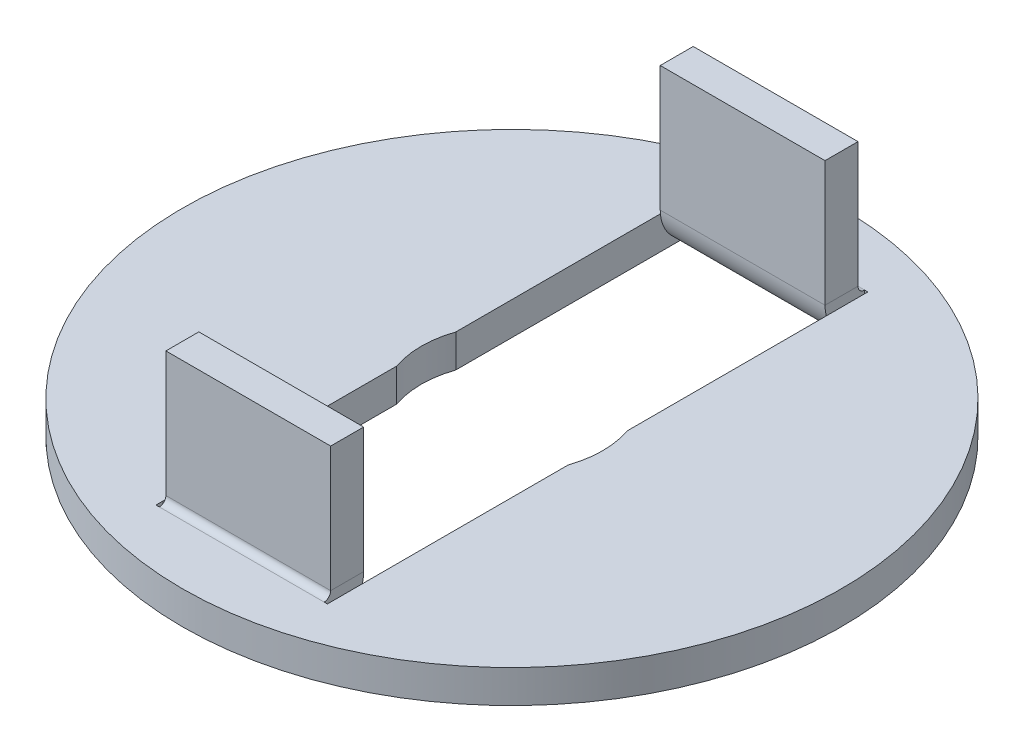
ISO-10303-21;
HEADER;
FILE_DESCRIPTION(('STEP AP214'),'2;1');
FILE_NAME('part.step','',(''),(''),'','','');
FILE_SCHEMA(('AUTOMOTIVE_DESIGN { 1 0 10303 214 1 1 1 1 }'));
ENDSEC;
DATA;
#1=APPLICATION_CONTEXT('core data for automotive mechanical design processes');
#2=APPLICATION_PROTOCOL_DEFINITION('international standard','automotive_design',2000,#1);
#3=PRODUCT_CONTEXT('',#1,'mechanical');
#4=PRODUCT('Part','Part','',(#3));
#5=PRODUCT_RELATED_PRODUCT_CATEGORY('part','',(#4));
#6=PRODUCT_DEFINITION_FORMATION('','',#4);
#7=PRODUCT_DEFINITION_CONTEXT('part definition',#1,'design');
#8=PRODUCT_DEFINITION('design','',#6,#7);
#9=PRODUCT_DEFINITION_SHAPE('','',#8);
#10=(LENGTH_UNIT() NAMED_UNIT(*) SI_UNIT(.MILLI.,.METRE.));
#11=(NAMED_UNIT(*) PLANE_ANGLE_UNIT() SI_UNIT($,.RADIAN.));
#12=(NAMED_UNIT(*) SI_UNIT($,.STERADIAN.) SOLID_ANGLE_UNIT());
#13=UNCERTAINTY_MEASURE_WITH_UNIT(LENGTH_MEASURE(1.E-05),#10,'distance_accuracy_value','');
#14=(GEOMETRIC_REPRESENTATION_CONTEXT(3) GLOBAL_UNCERTAINTY_ASSIGNED_CONTEXT((#13)) GLOBAL_UNIT_ASSIGNED_CONTEXT((#10,
#11,#12)) REPRESENTATION_CONTEXT('',''));
#15=CARTESIAN_POINT('',(0.,0.,0.));
#16=DIRECTION('',(0.,0.,1.));
#17=DIRECTION('',(1.,0.,0.));
#18=AXIS2_PLACEMENT_3D('',#15,#16,#17);
#19=CARTESIAN_POINT('',(0.,1.,8.19999999999999));
#20=DIRECTION('',(0.,0.,1.));
#21=DIRECTION('',(1.,0.,0.));
#22=AXIS2_PLACEMENT_3D('',#19,#20,#21);
#23=PLANE('',#22);
#24=DIRECTION('',(0.,1.,0.));
#25=VECTOR('',#24,1.);
#26=CARTESIAN_POINT('',(-2.5,1.,8.19999999999999));
#27=LINE('',#26,#25);
#28=CARTESIAN_POINT('',(-2.5,0.,8.19999999999999));
#29=VERTEX_POINT('',#28);
#30=CARTESIAN_POINT('',(-2.5,1.,8.2));
#31=VERTEX_POINT('',#30);
#32=EDGE_CURVE('E12',#29,#31,#27,.T.);
#33=ORIENTED_EDGE('',*,*,#32,.F.);
#34=DIRECTION('',(-1.,0.,0.));
#35=VECTOR('',#34,1.);
#36=CARTESIAN_POINT('',(0.,0.,8.19999999999999));
#37=LINE('',#36,#35);
#38=CARTESIAN_POINT('',(-2.6,0.,8.19999999999999));
#39=VERTEX_POINT('',#38);
#40=EDGE_CURVE('E312',#39,#29,#37,.F.);
#41=ORIENTED_EDGE('',*,*,#40,.F.);
#42=DIRECTION('',(0.,1.,0.));
#43=VECTOR('',#42,1.);
#44=CARTESIAN_POINT('',(-2.6,1.,8.19999999999999));
#45=LINE('',#44,#43);
#46=CARTESIAN_POINT('',(-2.6,1.,8.19999999999999));
#47=VERTEX_POINT('',#46);
#48=EDGE_CURVE('E54',#39,#47,#45,.T.);
#49=ORIENTED_EDGE('',*,*,#48,.T.);
#50=DIRECTION('',(-1.,0.,0.));
#51=VECTOR('',#50,1.);
#52=CARTESIAN_POINT('',(0.,1.,8.19999999999999));
#53=LINE('',#52,#51);
#54=EDGE_CURVE('E395',#47,#31,#53,.F.);
#55=ORIENTED_EDGE('',*,*,#54,.T.);
#56=EDGE_LOOP('',(#33,#41,#49,#55));
#57=FACE_BOUND('',#56,.T.);
#58=ADVANCED_FACE('F44',(#57),#23,.F.);
#59=CARTESIAN_POINT('',(-2.6,1.,0.));
#60=DIRECTION('',(-1.,0.,0.));
#61=DIRECTION('',(0.,0.,1.));
#62=AXIS2_PLACEMENT_3D('',#59,#60,#61);
#63=PLANE('',#62);
#64=ORIENTED_EDGE('',*,*,#48,.F.);
#65=DIRECTION('',(0.,0.,1.));
#66=VECTOR('',#65,1.);
#67=CARTESIAN_POINT('',(-2.6,0.,0.));
#68=LINE('',#67,#66);
#69=CARTESIAN_POINT('',(-2.6,0.,8.));
#70=VERTEX_POINT('',#69);
#71=EDGE_CURVE('E313',#70,#39,#68,.T.);
#72=ORIENTED_EDGE('',*,*,#71,.F.);
#73=DIRECTION('',(0.,1.,0.));
#74=VECTOR('',#73,1.);
#75=CARTESIAN_POINT('',(-2.6,1.,8.));
#76=LINE('',#75,#74);
#77=CARTESIAN_POINT('',(-2.6,1.,8.));
#78=VERTEX_POINT('',#77);
#79=EDGE_CURVE('E341',#70,#78,#76,.T.);
#80=ORIENTED_EDGE('',*,*,#79,.T.);
#81=DIRECTION('',(0.,0.,1.));
#82=VECTOR('',#81,1.);
#83=CARTESIAN_POINT('',(-2.6,1.,0.));
#84=LINE('',#83,#82);
#85=EDGE_CURVE('E392',#78,#47,#84,.T.);
#86=ORIENTED_EDGE('',*,*,#85,.T.);
#87=EDGE_LOOP('',(#64,#72,#80,#86));
#88=FACE_BOUND('',#87,.T.);
#89=ADVANCED_FACE('F504',(#88),#63,.F.);
#90=CARTESIAN_POINT('',(-2.6,1.,-8.));
#91=DIRECTION('',(-1.,0.,0.));
#92=DIRECTION('',(0.,0.,1.));
#93=AXIS2_PLACEMENT_3D('',#90,#91,#92);
#94=PLANE('',#93);
#95=DIRECTION('',(0.,0.,-1.));
#96=VECTOR('',#95,1.);
#97=CARTESIAN_POINT('',(-2.6,1.,-8.));
#98=LINE('',#97,#96);
#99=CARTESIAN_POINT('',(-2.6,1.,0.895823643358446));
#100=VERTEX_POINT('',#99);
#101=EDGE_CURVE('E400',#100,#78,#98,.F.);
#102=ORIENTED_EDGE('',*,*,#101,.T.);
#103=ORIENTED_EDGE('',*,*,#79,.F.);
#104=DIRECTION('',(0.,0.,1.));
#105=VECTOR('',#104,1.);
#106=CARTESIAN_POINT('',(-2.6,0.,0.));
#107=LINE('',#106,#105);
#108=CARTESIAN_POINT('',(-2.6,0.,0.895823643358446));
#109=VERTEX_POINT('',#108);
#110=EDGE_CURVE('E308',#109,#70,#107,.T.);
#111=ORIENTED_EDGE('',*,*,#110,.F.);
#112=DIRECTION('',(0.,1.,0.));
#113=VECTOR('',#112,1.);
#114=CARTESIAN_POINT('',(-2.6,1.,0.895823643358446));
#115=LINE('',#114,#113);
#116=EDGE_CURVE('E344',#109,#100,#115,.T.);
#117=ORIENTED_EDGE('',*,*,#116,.T.);
#118=EDGE_LOOP('',(#102,#103,#111,#117));
#119=FACE_BOUND('',#118,.T.);
#120=ADVANCED_FACE('F509',(#119),#94,.F.);
#121=CARTESIAN_POINT('',(0.,1.,0.));
#122=DIRECTION('',(0.,1.,0.));
#123=DIRECTION('',(0.,0.,1.));
#124=AXIS2_PLACEMENT_3D('',#121,#122,#123);
#125=CYLINDRICAL_SURFACE('',#124,2.75);
#126=ORIENTED_EDGE('',*,*,#116,.F.);
#127=CARTESIAN_POINT('',(0.,0.,0.));
#128=DIRECTION('',(0.,1.,0.));
#129=DIRECTION('',(0.,0.,1.));
#130=AXIS2_PLACEMENT_3D('',#127,#128,#129);
#131=CIRCLE('',#130,2.75);
#132=CARTESIAN_POINT('',(-2.6,0.,-0.895823643358446));
#133=VERTEX_POINT('',#132);
#134=EDGE_CURVE('E286',#133,#109,#131,.T.);
#135=ORIENTED_EDGE('',*,*,#134,.F.);
#136=DIRECTION('',(0.,1.,0.));
#137=VECTOR('',#136,1.);
#138=CARTESIAN_POINT('',(-2.6,1.,-0.895823643358446));
#139=LINE('',#138,#137);
#140=CARTESIAN_POINT('',(-2.6,1.,-0.895823643358446));
#141=VERTEX_POINT('',#140);
#142=EDGE_CURVE('E153',#133,#141,#139,.T.);
#143=ORIENTED_EDGE('',*,*,#142,.T.);
#144=CARTESIAN_POINT('',(0.,1.,0.));
#145=DIRECTION('',(0.,1.,0.));
#146=DIRECTION('',(0.,0.,1.));
#147=AXIS2_PLACEMENT_3D('',#144,#145,#146);
#148=CIRCLE('',#147,2.75);
#149=EDGE_CURVE('E403',#141,#100,#148,.T.);
#150=ORIENTED_EDGE('',*,*,#149,.T.);
#151=EDGE_LOOP('',(#126,#135,#143,#150));
#152=FACE_BOUND('',#151,.T.);
#153=ADVANCED_FACE('F525',(#152),#125,.F.);
#154=CARTESIAN_POINT('',(-2.6,1.,0.));
#155=DIRECTION('',(-1.,0.,0.));
#156=DIRECTION('',(0.,0.,1.));
#157=AXIS2_PLACEMENT_3D('',#154,#155,#156);
#158=PLANE('',#157);
#159=DIRECTION('',(0.,1.,0.));
#160=VECTOR('',#159,1.);
#161=CARTESIAN_POINT('',(-2.6,1.,-8.));
#162=LINE('',#161,#160);
#163=CARTESIAN_POINT('',(-2.6,0.,-8.));
#164=VERTEX_POINT('',#163);
#165=CARTESIAN_POINT('',(-2.6,1.,-8.));
#166=VERTEX_POINT('',#165);
#167=EDGE_CURVE('E337',#164,#166,#162,.T.);
#168=ORIENTED_EDGE('',*,*,#167,.T.);
#169=DIRECTION('',(0.,0.,-1.));
#170=VECTOR('',#169,1.);
#171=CARTESIAN_POINT('',(-2.6,1.,-8.));
#172=LINE('',#171,#170);
#173=EDGE_CURVE('E48',#166,#141,#172,.F.);
#174=ORIENTED_EDGE('',*,*,#173,.T.);
#175=ORIENTED_EDGE('',*,*,#142,.F.);
#176=DIRECTION('',(0.,0.,1.));
#177=VECTOR('',#176,1.);
#178=CARTESIAN_POINT('',(-2.6,0.,0.));
#179=LINE('',#178,#177);
#180=EDGE_CURVE('E302',#164,#133,#179,.T.);
#181=ORIENTED_EDGE('',*,*,#180,.F.);
#182=EDGE_LOOP('',(#168,#174,#175,#181));
#183=FACE_BOUND('',#182,.T.);
#184=ADVANCED_FACE('F530',(#183),#158,.F.);
#185=ORIENTED_EDGE('',*,*,#167,.F.);
#186=DIRECTION('',(0.,0.,1.));
#187=VECTOR('',#186,1.);
#188=CARTESIAN_POINT('',(-2.6,0.,0.));
#189=LINE('',#188,#187);
#190=CARTESIAN_POINT('',(-2.6,0.,-8.19999999999999));
#191=VERTEX_POINT('',#190);
#192=EDGE_CURVE('E298',#191,#164,#189,.T.);
#193=ORIENTED_EDGE('',*,*,#192,.F.);
#194=DIRECTION('',(0.,1.,0.));
#195=VECTOR('',#194,1.);
#196=CARTESIAN_POINT('',(-2.6,1.,-8.19999999999999));
#197=LINE('',#196,#195);
#198=CARTESIAN_POINT('',(-2.6,1.,-8.19999999999999));
#199=VERTEX_POINT('',#198);
#200=EDGE_CURVE('E340',#191,#199,#197,.T.);
#201=ORIENTED_EDGE('',*,*,#200,.T.);
#202=DIRECTION('',(0.,0.,1.));
#203=VECTOR('',#202,1.);
#204=CARTESIAN_POINT('',(-2.6,1.,0.));
#205=LINE('',#204,#203);
#206=EDGE_CURVE('E383',#199,#166,#205,.T.);
#207=ORIENTED_EDGE('',*,*,#206,.T.);
#208=EDGE_LOOP('',(#185,#193,#201,#207));
#209=FACE_BOUND('',#208,.T.);
#210=ADVANCED_FACE('F518',(#209),#158,.F.);
#211=CARTESIAN_POINT('',(0.,1.,-8.19999999999999));
#212=DIRECTION('',(0.,0.,-1.));
#213=DIRECTION('',(-1.,0.,0.));
#214=AXIS2_PLACEMENT_3D('',#211,#212,#213);
#215=PLANE('',#214);
#216=ORIENTED_EDGE('',*,*,#200,.F.);
#217=DIRECTION('',(1.,0.,0.));
#218=VECTOR('',#217,1.);
#219=CARTESIAN_POINT('',(0.,0.,-8.19999999999999));
#220=LINE('',#219,#218);
#221=CARTESIAN_POINT('',(-2.5,0.,-8.2));
#222=VERTEX_POINT('',#221);
#223=EDGE_CURVE('E301',#222,#191,#220,.F.);
#224=ORIENTED_EDGE('',*,*,#223,.F.);
#225=DIRECTION('',(0.,1.,0.));
#226=VECTOR('',#225,1.);
#227=CARTESIAN_POINT('',(-2.5,1.,-8.2));
#228=LINE('',#227,#226);
#229=CARTESIAN_POINT('',(-2.5,1.,-8.19999999999999));
#230=VERTEX_POINT('',#229);
#231=EDGE_CURVE('E235',#222,#230,#228,.T.);
#232=ORIENTED_EDGE('',*,*,#231,.T.);
#233=DIRECTION('',(1.,0.,0.));
#234=VECTOR('',#233,1.);
#235=CARTESIAN_POINT('',(0.,1.,-8.19999999999999));
#236=LINE('',#235,#234);
#237=EDGE_CURVE('E389',#230,#199,#236,.F.);
#238=ORIENTED_EDGE('',*,*,#237,.T.);
#239=EDGE_LOOP('',(#216,#224,#232,#238));
#240=FACE_BOUND('',#239,.T.);
#241=ADVANCED_FACE('F515',(#240),#215,.F.);
#242=CARTESIAN_POINT('',(-2.5,1.2,-8.2));
#243=DIRECTION('',(1.,0.,0.));
#244=DIRECTION('',(0.,0.,-1.));
#245=AXIS2_PLACEMENT_3D('',#242,#243,#244);
#246=PLANE('',#245);
#247=ORIENTED_EDGE('',*,*,#231,.F.);
#248=CARTESIAN_POINT('',(-2.5,1.2,-8.2));
#249=DIRECTION('',(1.,0.,0.));
#250=DIRECTION('',(0.,0.,-1.));
#251=AXIS2_PLACEMENT_3D('',#248,#249,#250);
#252=CIRCLE('',#251,1.2);
#253=CARTESIAN_POINT('',(-2.5,1.2,-7.));
#254=VERTEX_POINT('',#253);
#255=EDGE_CURVE('E234',#222,#254,#252,.F.);
#256=ORIENTED_EDGE('',*,*,#255,.T.);
#257=DIRECTION('',(0.,0.,-1.));
#258=VECTOR('',#257,1.);
#259=CARTESIAN_POINT('',(-2.5,1.2,-8.2));
#260=LINE('',#259,#258);
#261=CARTESIAN_POINT('',(-2.5,1.2,-8.));
#262=VERTEX_POINT('',#261);
#263=EDGE_CURVE('E214',#254,#262,#260,.T.);
#264=ORIENTED_EDGE('',*,*,#263,.T.);
#265=CARTESIAN_POINT('',(-2.5,1.2,-8.2));
#266=DIRECTION('',(1.,0.,0.));
#267=DIRECTION('',(0.,0.,-1.));
#268=AXIS2_PLACEMENT_3D('',#265,#266,#267);
#269=CIRCLE('',#268,0.2);
#270=EDGE_CURVE('E231',#230,#262,#269,.F.);
#271=ORIENTED_EDGE('',*,*,#270,.F.);
#272=EDGE_LOOP('',(#247,#256,#264,#271));
#273=FACE_BOUND('',#272,.T.);
#274=ADVANCED_FACE('F230',(#273),#246,.F.);
#275=CARTESIAN_POINT('',(-2.5,5.,-8.));
#276=DIRECTION('',(-1.,0.,0.));
#277=DIRECTION('',(0.,-1.,0.));
#278=AXIS2_PLACEMENT_3D('',#275,#276,#277);
#279=PLANE('',#278);
#280=DIRECTION('',(0.,-1.,0.));
#281=VECTOR('',#280,1.);
#282=CARTESIAN_POINT('',(-2.5,5.,-8.));
#283=LINE('',#282,#281);
#284=CARTESIAN_POINT('',(-2.5,5.,-8.));
#285=VERTEX_POINT('',#284);
#286=EDGE_CURVE('E211',#285,#262,#283,.T.);
#287=ORIENTED_EDGE('',*,*,#286,.T.);
#288=ORIENTED_EDGE('',*,*,#263,.F.);
#289=DIRECTION('',(0.,-1.,0.));
#290=VECTOR('',#289,1.);
#291=CARTESIAN_POINT('',(-2.5,5.,-7.));
#292=LINE('',#291,#290);
#293=CARTESIAN_POINT('',(-2.5,5.,-7.));
#294=VERTEX_POINT('',#293);
#295=EDGE_CURVE('E305',#254,#294,#292,.F.);
#296=ORIENTED_EDGE('',*,*,#295,.T.);
#297=DIRECTION('',(0.,0.,-1.));
#298=VECTOR('',#297,1.);
#299=CARTESIAN_POINT('',(-2.5,5.,-8.));
#300=LINE('',#299,#298);
#301=EDGE_CURVE('E217',#294,#285,#300,.T.);
#302=ORIENTED_EDGE('',*,*,#301,.T.);
#303=EDGE_LOOP('',(#287,#288,#296,#302));
#304=FACE_BOUND('',#303,.T.);
#305=ADVANCED_FACE('F213',(#304),#279,.T.);
#306=CARTESIAN_POINT('',(-2.5,5.,-8.));
#307=DIRECTION('',(0.,1.,0.));
#308=DIRECTION('',(-1.,0.,0.));
#309=AXIS2_PLACEMENT_3D('',#306,#307,#308);
#310=PLANE('',#309);
#311=ORIENTED_EDGE('',*,*,#301,.F.);
#312=DIRECTION('',(1.,0.,0.));
#313=VECTOR('',#312,1.);
#314=CARTESIAN_POINT('',(-2.5,5.,-7.));
#315=LINE('',#314,#313);
#316=CARTESIAN_POINT('',(2.5,5.,-7.));
#317=VERTEX_POINT('',#316);
#318=EDGE_CURVE('E287',#317,#294,#315,.F.);
#319=ORIENTED_EDGE('',*,*,#318,.F.);
#320=DIRECTION('',(0.,0.,-1.));
#321=VECTOR('',#320,1.);
#322=CARTESIAN_POINT('',(2.5,5.,-8.));
#323=LINE('',#322,#321);
#324=CARTESIAN_POINT('',(2.5,5.,-8.));
#325=VERTEX_POINT('',#324);
#326=EDGE_CURVE('E332',#317,#325,#323,.T.);
#327=ORIENTED_EDGE('',*,*,#326,.T.);
#328=DIRECTION('',(-1.,0.,0.));
#329=VECTOR('',#328,1.);
#330=CARTESIAN_POINT('',(-2.5,5.,-8.));
#331=LINE('',#330,#329);
#332=EDGE_CURVE('E222',#325,#285,#331,.T.);
#333=ORIENTED_EDGE('',*,*,#332,.T.);
#334=EDGE_LOOP('',(#311,#319,#327,#333));
#335=FACE_BOUND('',#334,.T.);
#336=ADVANCED_FACE('F543',(#335),#310,.T.);
#337=CARTESIAN_POINT('',(2.5,5.,-8.));
#338=DIRECTION('',(-1.,0.,0.));
#339=DIRECTION('',(0.,-1.,0.));
#340=AXIS2_PLACEMENT_3D('',#337,#338,#339);
#341=PLANE('',#340);
#342=DIRECTION('',(0.,0.,1.));
#343=VECTOR('',#342,1.);
#344=CARTESIAN_POINT('',(2.5,1.2,-8.));
#345=LINE('',#344,#343);
#346=CARTESIAN_POINT('',(2.5,1.2,-7.));
#347=VERTEX_POINT('',#346);
#348=CARTESIAN_POINT('',(2.5,1.2,-8.));
#349=VERTEX_POINT('',#348);
#350=EDGE_CURVE('E335',#347,#349,#345,.F.);
#351=ORIENTED_EDGE('',*,*,#350,.T.);
#352=DIRECTION('',(0.,-1.,0.));
#353=VECTOR('',#352,1.);
#354=CARTESIAN_POINT('',(2.5,5.,-8.));
#355=LINE('',#354,#353);
#356=EDGE_CURVE('E249',#325,#349,#355,.T.);
#357=ORIENTED_EDGE('',*,*,#356,.F.);
#358=ORIENTED_EDGE('',*,*,#326,.F.);
#359=DIRECTION('',(0.,1.,0.));
#360=VECTOR('',#359,1.);
#361=CARTESIAN_POINT('',(2.5,5.,-7.));
#362=LINE('',#361,#360);
#363=EDGE_CURVE('E274',#317,#347,#362,.F.);
#364=ORIENTED_EDGE('',*,*,#363,.T.);
#365=EDGE_LOOP('',(#351,#357,#358,#364));
#366=FACE_BOUND('',#365,.T.);
#367=ADVANCED_FACE('F547',(#366),#341,.F.);
#368=CARTESIAN_POINT('',(2.5,1.2,-8.2));
#369=DIRECTION('',(-1.,0.,0.));
#370=DIRECTION('',(0.,0.,1.));
#371=AXIS2_PLACEMENT_3D('',#368,#369,#370);
#372=PLANE('',#371);
#373=ORIENTED_EDGE('',*,*,#350,.F.);
#374=CARTESIAN_POINT('',(2.5,1.2,-8.2));
#375=DIRECTION('',(-1.,0.,0.));
#376=DIRECTION('',(0.,0.,1.));
#377=AXIS2_PLACEMENT_3D('',#374,#375,#376);
#378=CIRCLE('',#377,1.2);
#379=CARTESIAN_POINT('',(2.5,0.,-8.19999999999999));
#380=VERTEX_POINT('',#379);
#381=EDGE_CURVE('E356',#347,#380,#378,.F.);
#382=ORIENTED_EDGE('',*,*,#381,.T.);
#383=DIRECTION('',(0.,1.,0.));
#384=VECTOR('',#383,1.);
#385=CARTESIAN_POINT('',(2.5,1.,-8.19999999999999));
#386=LINE('',#385,#384);
#387=CARTESIAN_POINT('',(2.5,1.,-8.2));
#388=VERTEX_POINT('',#387);
#389=EDGE_CURVE('E359',#380,#388,#386,.T.);
#390=ORIENTED_EDGE('',*,*,#389,.T.);
#391=CARTESIAN_POINT('',(2.5,1.2,-8.2));
#392=DIRECTION('',(-1.,0.,0.));
#393=DIRECTION('',(0.,0.,1.));
#394=AXIS2_PLACEMENT_3D('',#391,#392,#393);
#395=CIRCLE('',#394,0.2);
#396=EDGE_CURVE('E244',#349,#388,#395,.F.);
#397=ORIENTED_EDGE('',*,*,#396,.F.);
#398=EDGE_LOOP('',(#373,#382,#390,#397));
#399=FACE_BOUND('',#398,.T.);
#400=ADVANCED_FACE('F523',(#399),#372,.F.);
#401=CARTESIAN_POINT('',(0.,1.,-8.19999999999999));
#402=DIRECTION('',(0.,0.,-1.));
#403=DIRECTION('',(-1.,0.,0.));
#404=AXIS2_PLACEMENT_3D('',#401,#402,#403);
#405=PLANE('',#404);
#406=ORIENTED_EDGE('',*,*,#389,.F.);
#407=DIRECTION('',(1.,0.,0.));
#408=VECTOR('',#407,1.);
#409=CARTESIAN_POINT('',(0.,0.,-8.19999999999999));
#410=LINE('',#409,#408);
#411=CARTESIAN_POINT('',(2.6,0.,-8.19999999999999));
#412=VERTEX_POINT('',#411);
#413=EDGE_CURVE('E291',#412,#380,#410,.F.);
#414=ORIENTED_EDGE('',*,*,#413,.F.);
#415=DIRECTION('',(0.,1.,0.));
#416=VECTOR('',#415,1.);
#417=CARTESIAN_POINT('',(2.6,1.,-8.19999999999999));
#418=LINE('',#417,#416);
#419=CARTESIAN_POINT('',(2.6,1.,-8.19999999999999));
#420=VERTEX_POINT('',#419);
#421=EDGE_CURVE('E330',#412,#420,#418,.T.);
#422=ORIENTED_EDGE('',*,*,#421,.T.);
#423=DIRECTION('',(1.,0.,0.));
#424=VECTOR('',#423,1.);
#425=CARTESIAN_POINT('',(0.,1.,-8.19999999999999));
#426=LINE('',#425,#424);
#427=EDGE_CURVE('E63',#420,#388,#426,.F.);
#428=ORIENTED_EDGE('',*,*,#427,.T.);
#429=EDGE_LOOP('',(#406,#414,#422,#428));
#430=FACE_BOUND('',#429,.T.);
#431=ADVANCED_FACE('F520',(#430),#405,.F.);
#432=CARTESIAN_POINT('',(2.6,1.,0.));
#433=DIRECTION('',(1.,0.,0.));
#434=DIRECTION('',(0.,0.,-1.));
#435=AXIS2_PLACEMENT_3D('',#432,#433,#434);
#436=PLANE('',#435);
#437=ORIENTED_EDGE('',*,*,#421,.F.);
#438=DIRECTION('',(0.,0.,1.));
#439=VECTOR('',#438,1.);
#440=CARTESIAN_POINT('',(2.6,0.,0.));
#441=LINE('',#440,#439);
#442=CARTESIAN_POINT('',(2.6,0.,-8.));
#443=VERTEX_POINT('',#442);
#444=EDGE_CURVE('E292',#443,#412,#441,.F.);
#445=ORIENTED_EDGE('',*,*,#444,.F.);
#446=DIRECTION('',(0.,1.,0.));
#447=VECTOR('',#446,1.);
#448=CARTESIAN_POINT('',(2.6,1.,-8.));
#449=LINE('',#448,#447);
#450=CARTESIAN_POINT('',(2.6,1.,-8.));
#451=VERTEX_POINT('',#450);
#452=EDGE_CURVE('E327',#443,#451,#449,.T.);
#453=ORIENTED_EDGE('',*,*,#452,.T.);
#454=DIRECTION('',(0.,0.,-1.));
#455=VECTOR('',#454,1.);
#456=CARTESIAN_POINT('',(2.6,1.,0.));
#457=LINE('',#456,#455);
#458=EDGE_CURVE('E384',#451,#420,#457,.T.);
#459=ORIENTED_EDGE('',*,*,#458,.T.);
#460=EDGE_LOOP('',(#437,#445,#453,#459));
#461=FACE_BOUND('',#460,.T.);
#462=ADVANCED_FACE('F522',(#461),#436,.F.);
#463=CARTESIAN_POINT('',(2.6,1.,8.));
#464=DIRECTION('',(1.,0.,0.));
#465=DIRECTION('',(0.,0.,-1.));
#466=AXIS2_PLACEMENT_3D('',#463,#464,#465);
#467=PLANE('',#466);
#468=DIRECTION('',(0.,0.,1.));
#469=VECTOR('',#468,1.);
#470=CARTESIAN_POINT('',(2.6,1.,8.));
#471=LINE('',#470,#469);
#472=CARTESIAN_POINT('',(2.6,1.,-0.895823643358448));
#473=VERTEX_POINT('',#472);
#474=EDGE_CURVE('E406',#473,#451,#471,.F.);
#475=ORIENTED_EDGE('',*,*,#474,.T.);
#476=ORIENTED_EDGE('',*,*,#452,.F.);
#477=DIRECTION('',(0.,0.,1.));
#478=VECTOR('',#477,1.);
#479=CARTESIAN_POINT('',(2.6,0.,0.));
#480=LINE('',#479,#478);
#481=CARTESIAN_POINT('',(2.6,0.,-0.895823643358448));
#482=VERTEX_POINT('',#481);
#483=EDGE_CURVE('E288',#482,#443,#480,.F.);
#484=ORIENTED_EDGE('',*,*,#483,.F.);
#485=DIRECTION('',(0.,1.,0.));
#486=VECTOR('',#485,1.);
#487=CARTESIAN_POINT('',(2.6,1.,-0.895823643358448));
#488=LINE('',#487,#486);
#489=EDGE_CURVE('E331',#482,#473,#488,.T.);
#490=ORIENTED_EDGE('',*,*,#489,.T.);
#491=EDGE_LOOP('',(#475,#476,#484,#490));
#492=FACE_BOUND('',#491,.T.);
#493=ADVANCED_FACE('F46',(#492),#467,.F.);
#494=ORIENTED_EDGE('',*,*,#489,.F.);
#495=CARTESIAN_POINT('',(0.,0.,0.));
#496=DIRECTION('',(0.,1.,0.));
#497=DIRECTION('',(0.,0.,1.));
#498=AXIS2_PLACEMENT_3D('',#495,#496,#497);
#499=CIRCLE('',#498,2.75);
#500=CARTESIAN_POINT('',(2.6,0.,0.895823643358449));
#501=VERTEX_POINT('',#500);
#502=EDGE_CURVE('E283',#501,#482,#499,.T.);
#503=ORIENTED_EDGE('',*,*,#502,.F.);
#504=DIRECTION('',(0.,1.,0.));
#505=VECTOR('',#504,1.);
#506=CARTESIAN_POINT('',(2.6,1.,0.895823643358449));
#507=LINE('',#506,#505);
#508=CARTESIAN_POINT('',(2.6,1.,0.895823643358449));
#509=VERTEX_POINT('',#508);
#510=EDGE_CURVE('E325',#501,#509,#507,.T.);
#511=ORIENTED_EDGE('',*,*,#510,.T.);
#512=EDGE_CURVE('E408',#509,#473,#148,.T.);
#513=ORIENTED_EDGE('',*,*,#512,.T.);
#514=EDGE_LOOP('',(#494,#503,#511,#513));
#515=FACE_BOUND('',#514,.T.);
#516=ADVANCED_FACE('F532',(#515),#125,.F.);
#517=CARTESIAN_POINT('',(2.6,1.,0.));
#518=DIRECTION('',(1.,0.,0.));
#519=DIRECTION('',(0.,0.,-1.));
#520=AXIS2_PLACEMENT_3D('',#517,#518,#519);
#521=PLANE('',#520);
#522=DIRECTION('',(0.,1.,0.));
#523=VECTOR('',#522,1.);
#524=CARTESIAN_POINT('',(2.6,1.,8.));
#525=LINE('',#524,#523);
#526=CARTESIAN_POINT('',(2.6,0.,8.));
#527=VERTEX_POINT('',#526);
#528=CARTESIAN_POINT('',(2.6,1.,8.));
#529=VERTEX_POINT('',#528);
#530=EDGE_CURVE('E322',#527,#529,#525,.T.);
#531=ORIENTED_EDGE('',*,*,#530,.T.);
#532=DIRECTION('',(0.,0.,1.));
#533=VECTOR('',#532,1.);
#534=CARTESIAN_POINT('',(2.6,1.,8.));
#535=LINE('',#534,#533);
#536=EDGE_CURVE('E404',#529,#509,#535,.F.);
#537=ORIENTED_EDGE('',*,*,#536,.T.);
#538=ORIENTED_EDGE('',*,*,#510,.F.);
#539=DIRECTION('',(0.,0.,1.));
#540=VECTOR('',#539,1.);
#541=CARTESIAN_POINT('',(2.6,0.,0.));
#542=LINE('',#541,#540);
#543=EDGE_CURVE('E280',#527,#501,#542,.F.);
#544=ORIENTED_EDGE('',*,*,#543,.F.);
#545=EDGE_LOOP('',(#531,#537,#538,#544));
#546=FACE_BOUND('',#545,.T.);
#547=ADVANCED_FACE('F574',(#546),#521,.F.);
#548=ORIENTED_EDGE('',*,*,#530,.F.);
#549=DIRECTION('',(0.,0.,1.));
#550=VECTOR('',#549,1.);
#551=CARTESIAN_POINT('',(2.6,0.,0.));
#552=LINE('',#551,#550);
#553=CARTESIAN_POINT('',(2.6,0.,8.19999999999999));
#554=VERTEX_POINT('',#553);
#555=EDGE_CURVE('E276',#554,#527,#552,.F.);
#556=ORIENTED_EDGE('',*,*,#555,.F.);
#557=DIRECTION('',(0.,1.,0.));
#558=VECTOR('',#557,1.);
#559=CARTESIAN_POINT('',(2.6,1.,8.19999999999999));
#560=LINE('',#559,#558);
#561=CARTESIAN_POINT('',(2.6,1.,8.19999999999999));
#562=VERTEX_POINT('',#561);
#563=EDGE_CURVE('E326',#554,#562,#560,.T.);
#564=ORIENTED_EDGE('',*,*,#563,.T.);
#565=DIRECTION('',(0.,0.,-1.));
#566=VECTOR('',#565,1.);
#567=CARTESIAN_POINT('',(2.6,1.,0.));
#568=LINE('',#567,#566);
#569=EDGE_CURVE('E378',#562,#529,#568,.T.);
#570=ORIENTED_EDGE('',*,*,#569,.T.);
#571=EDGE_LOOP('',(#548,#556,#564,#570));
#572=FACE_BOUND('',#571,.T.);
#573=ADVANCED_FACE('F464',(#572),#521,.F.);
#574=CARTESIAN_POINT('',(0.,1.,8.19999999999999));
#575=DIRECTION('',(0.,0.,1.));
#576=DIRECTION('',(1.,0.,0.));
#577=AXIS2_PLACEMENT_3D('',#574,#575,#576);
#578=PLANE('',#577);
#579=ORIENTED_EDGE('',*,*,#563,.F.);
#580=DIRECTION('',(-1.,0.,0.));
#581=VECTOR('',#580,1.);
#582=CARTESIAN_POINT('',(0.,0.,8.19999999999999));
#583=LINE('',#582,#581);
#584=CARTESIAN_POINT('',(2.5,0.,8.19999999999999));
#585=VERTEX_POINT('',#584);
#586=EDGE_CURVE('E279',#585,#554,#583,.F.);
#587=ORIENTED_EDGE('',*,*,#586,.F.);
#588=DIRECTION('',(0.,1.,0.));
#589=VECTOR('',#588,1.);
#590=CARTESIAN_POINT('',(2.5,1.,8.2));
#591=LINE('',#590,#589);
#592=CARTESIAN_POINT('',(2.5,1.,8.19999999999999));
#593=VERTEX_POINT('',#592);
#594=EDGE_CURVE('E364',#585,#593,#591,.T.);
#595=ORIENTED_EDGE('',*,*,#594,.T.);
#596=DIRECTION('',(-1.,0.,0.));
#597=VECTOR('',#596,1.);
#598=CARTESIAN_POINT('',(0.,1.,8.19999999999999));
#599=LINE('',#598,#597);
#600=EDGE_CURVE('E375',#593,#562,#599,.F.);
#601=ORIENTED_EDGE('',*,*,#600,.T.);
#602=EDGE_LOOP('',(#579,#587,#595,#601));
#603=FACE_BOUND('',#602,.T.);
#604=ADVANCED_FACE('F457',(#603),#578,.F.);
#605=CARTESIAN_POINT('',(2.5,1.2,8.2));
#606=DIRECTION('',(-1.,0.,0.));
#607=DIRECTION('',(0.,0.,1.));
#608=AXIS2_PLACEMENT_3D('',#605,#606,#607);
#609=PLANE('',#608);
#610=ORIENTED_EDGE('',*,*,#594,.F.);
#611=CARTESIAN_POINT('',(2.5,1.2,8.2));
#612=DIRECTION('',(-1.,0.,0.));
#613=DIRECTION('',(0.,0.,1.));
#614=AXIS2_PLACEMENT_3D('',#611,#612,#613);
#615=CIRCLE('',#614,1.2);
#616=CARTESIAN_POINT('',(2.5,1.2,7.));
#617=VERTEX_POINT('',#616);
#618=EDGE_CURVE('E348',#585,#617,#615,.F.);
#619=ORIENTED_EDGE('',*,*,#618,.T.);
#620=DIRECTION('',(0.,0.,1.));
#621=VECTOR('',#620,1.);
#622=CARTESIAN_POINT('',(2.5,1.2,8.2));
#623=LINE('',#622,#621);
#624=CARTESIAN_POINT('',(2.5,1.2,8.));
#625=VERTEX_POINT('',#624);
#626=EDGE_CURVE('E321',#617,#625,#623,.T.);
#627=ORIENTED_EDGE('',*,*,#626,.T.);
#628=CARTESIAN_POINT('',(2.5,1.2,8.2));
#629=DIRECTION('',(-1.,0.,0.));
#630=DIRECTION('',(0.,0.,1.));
#631=AXIS2_PLACEMENT_3D('',#628,#629,#630);
#632=CIRCLE('',#631,0.2);
#633=EDGE_CURVE('E352',#593,#625,#632,.F.);
#634=ORIENTED_EDGE('',*,*,#633,.F.);
#635=EDGE_LOOP('',(#610,#619,#627,#634));
#636=FACE_BOUND('',#635,.T.);
#637=ADVANCED_FACE('F453',(#636),#609,.F.);
#638=CARTESIAN_POINT('',(2.5,5.,8.));
#639=DIRECTION('',(1.,0.,0.));
#640=DIRECTION('',(0.,-1.,0.));
#641=AXIS2_PLACEMENT_3D('',#638,#639,#640);
#642=PLANE('',#641);
#643=DIRECTION('',(0.,-1.,0.));
#644=VECTOR('',#643,1.);
#645=CARTESIAN_POINT('',(2.5,5.,8.));
#646=LINE('',#645,#644);
#647=CARTESIAN_POINT('',(2.5,5.,8.));
#648=VERTEX_POINT('',#647);
#649=EDGE_CURVE('E424',#648,#625,#646,.T.);
#650=ORIENTED_EDGE('',*,*,#649,.T.);
#651=ORIENTED_EDGE('',*,*,#626,.F.);
#652=DIRECTION('',(0.,-1.,0.));
#653=VECTOR('',#652,1.);
#654=CARTESIAN_POINT('',(2.5,5.,7.));
#655=LINE('',#654,#653);
#656=CARTESIAN_POINT('',(2.5,5.,7.));
#657=VERTEX_POINT('',#656);
#658=EDGE_CURVE('E264',#617,#657,#655,.F.);
#659=ORIENTED_EDGE('',*,*,#658,.T.);
#660=DIRECTION('',(0.,0.,1.));
#661=VECTOR('',#660,1.);
#662=CARTESIAN_POINT('',(2.5,5.,8.));
#663=LINE('',#662,#661);
#664=EDGE_CURVE('E160',#657,#648,#663,.T.);
#665=ORIENTED_EDGE('',*,*,#664,.T.);
#666=EDGE_LOOP('',(#650,#651,#659,#665));
#667=FACE_BOUND('',#666,.T.);
#668=ADVANCED_FACE('F487',(#667),#642,.T.);
#669=CARTESIAN_POINT('',(-2.5,5.,8.));
#670=DIRECTION('',(0.,1.,0.));
#671=DIRECTION('',(1.,0.,0.));
#672=AXIS2_PLACEMENT_3D('',#669,#670,#671);
#673=PLANE('',#672);
#674=ORIENTED_EDGE('',*,*,#664,.F.);
#675=DIRECTION('',(-1.,0.,0.));
#676=VECTOR('',#675,1.);
#677=CARTESIAN_POINT('',(-2.5,5.,7.));
#678=LINE('',#677,#676);
#679=CARTESIAN_POINT('',(-2.5,5.,7.));
#680=VERTEX_POINT('',#679);
#681=EDGE_CURVE('E271',#680,#657,#678,.F.);
#682=ORIENTED_EDGE('',*,*,#681,.F.);
#683=DIRECTION('',(0.,0.,1.));
#684=VECTOR('',#683,1.);
#685=CARTESIAN_POINT('',(-2.5,5.,8.));
#686=LINE('',#685,#684);
#687=CARTESIAN_POINT('',(-2.5,5.,8.));
#688=VERTEX_POINT('',#687);
#689=EDGE_CURVE('E318',#680,#688,#686,.T.);
#690=ORIENTED_EDGE('',*,*,#689,.T.);
#691=DIRECTION('',(1.,0.,0.));
#692=VECTOR('',#691,1.);
#693=CARTESIAN_POINT('',(-2.5,5.,8.));
#694=LINE('',#693,#692);
#695=EDGE_CURVE('E427',#688,#648,#694,.T.);
#696=ORIENTED_EDGE('',*,*,#695,.T.);
#697=EDGE_LOOP('',(#674,#682,#690,#696));
#698=FACE_BOUND('',#697,.T.);
#699=ADVANCED_FACE('F489',(#698),#673,.T.);
#700=CARTESIAN_POINT('',(-2.5,5.,8.));
#701=DIRECTION('',(1.,0.,0.));
#702=DIRECTION('',(0.,-1.,0.));
#703=AXIS2_PLACEMENT_3D('',#700,#701,#702);
#704=PLANE('',#703);
#705=DIRECTION('',(0.,0.,-1.));
#706=VECTOR('',#705,1.);
#707=CARTESIAN_POINT('',(-2.5,1.2,8.));
#708=LINE('',#707,#706);
#709=CARTESIAN_POINT('',(-2.5,1.2,7.));
#710=VERTEX_POINT('',#709);
#711=CARTESIAN_POINT('',(-2.5,1.2,8.));
#712=VERTEX_POINT('',#711);
#713=EDGE_CURVE('E253',#710,#712,#708,.F.);
#714=ORIENTED_EDGE('',*,*,#713,.T.);
#715=DIRECTION('',(0.,-1.,0.));
#716=VECTOR('',#715,1.);
#717=CARTESIAN_POINT('',(-2.5,5.,8.));
#718=LINE('',#717,#716);
#719=EDGE_CURVE('E432',#688,#712,#718,.T.);
#720=ORIENTED_EDGE('',*,*,#719,.F.);
#721=ORIENTED_EDGE('',*,*,#689,.F.);
#722=DIRECTION('',(0.,1.,0.));
#723=VECTOR('',#722,1.);
#724=CARTESIAN_POINT('',(-2.5,5.,7.));
#725=LINE('',#724,#723);
#726=EDGE_CURVE('E282',#680,#710,#725,.F.);
#727=ORIENTED_EDGE('',*,*,#726,.T.);
#728=EDGE_LOOP('',(#714,#720,#721,#727));
#729=FACE_BOUND('',#728,.T.);
#730=ADVANCED_FACE('F490',(#729),#704,.F.);
#731=CARTESIAN_POINT('',(0.,1.,0.));
#732=DIRECTION('',(0.,1.,0.));
#733=DIRECTION('',(0.,0.,1.));
#734=AXIS2_PLACEMENT_3D('',#731,#732,#733);
#735=CYLINDRICAL_SURFACE('',#734,10.);
#736=CARTESIAN_POINT('',(0.,1.,0.));
#737=DIRECTION('',(0.,1.,0.));
#738=DIRECTION('',(0.,0.,1.));
#739=AXIS2_PLACEMENT_3D('',#736,#737,#738);
#740=CIRCLE('',#739,10.);
#741=CARTESIAN_POINT('',(0.,1.,10.));
#742=VERTEX_POINT('',#741);
#743=EDGE_CURVE('E421',#742,#742,#740,.T.);
#744=ORIENTED_EDGE('',*,*,#743,.F.);
#745=EDGE_LOOP('',(#744));
#746=FACE_BOUND('',#745,.T.);
#747=CARTESIAN_POINT('',(0.,0.,0.));
#748=DIRECTION('',(0.,1.,0.));
#749=DIRECTION('',(0.,0.,1.));
#750=AXIS2_PLACEMENT_3D('',#747,#748,#749);
#751=CIRCLE('',#750,10.);
#752=CARTESIAN_POINT('',(0.,0.,10.));
#753=VERTEX_POINT('',#752);
#754=EDGE_CURVE('E275',#753,#753,#751,.T.);
#755=ORIENTED_EDGE('',*,*,#754,.T.);
#756=EDGE_LOOP('',(#755));
#757=FACE_BOUND('',#756,.T.);
#758=ADVANCED_FACE('F492',(#746,#757),#735,.T.);
#759=CARTESIAN_POINT('',(-2.5,1.2,8.2));
#760=DIRECTION('',(1.,0.,0.));
#761=DIRECTION('',(0.,0.,-1.));
#762=AXIS2_PLACEMENT_3D('',#759,#760,#761);
#763=PLANE('',#762);
#764=CARTESIAN_POINT('',(-2.5,1.2,8.2));
#765=DIRECTION('',(1.,0.,0.));
#766=DIRECTION('',(0.,0.,-1.));
#767=AXIS2_PLACEMENT_3D('',#764,#765,#766);
#768=CIRCLE('',#767,1.2);
#769=EDGE_CURVE('E297',#710,#29,#768,.F.);
#770=ORIENTED_EDGE('',*,*,#769,.T.);
#771=ORIENTED_EDGE('',*,*,#32,.T.);
#772=CARTESIAN_POINT('',(-2.5,1.2,8.2));
#773=DIRECTION('',(1.,0.,0.));
#774=DIRECTION('',(0.,0.,-1.));
#775=AXIS2_PLACEMENT_3D('',#772,#773,#774);
#776=CIRCLE('',#775,0.2);
#777=EDGE_CURVE('E223',#712,#31,#776,.F.);
#778=ORIENTED_EDGE('',*,*,#777,.F.);
#779=ORIENTED_EDGE('',*,*,#713,.F.);
#780=EDGE_LOOP('',(#770,#771,#778,#779));
#781=FACE_BOUND('',#780,.T.);
#782=ADVANCED_FACE('F479',(#781),#763,.F.);
#783=CARTESIAN_POINT('',(-2.5,5.,8.));
#784=DIRECTION('',(0.,0.,-1.));
#785=DIRECTION('',(-1.,0.,0.));
#786=AXIS2_PLACEMENT_3D('',#783,#784,#785);
#787=PLANE('',#786);
#788=ORIENTED_EDGE('',*,*,#719,.T.);
#789=DIRECTION('',(1.,0.,0.));
#790=VECTOR('',#789,1.);
#791=CARTESIAN_POINT('',(-2.5,1.2,8.));
#792=LINE('',#791,#790);
#793=EDGE_CURVE('E256',#712,#625,#792,.T.);
#794=ORIENTED_EDGE('',*,*,#793,.T.);
#795=ORIENTED_EDGE('',*,*,#649,.F.);
#796=ORIENTED_EDGE('',*,*,#695,.F.);
#797=EDGE_LOOP('',(#788,#794,#795,#796));
#798=FACE_BOUND('',#797,.T.);
#799=ADVANCED_FACE('F444',(#798),#787,.F.);
#800=CARTESIAN_POINT('',(0.,1.,0.));
#801=DIRECTION('',(0.,1.,0.));
#802=DIRECTION('',(0.,0.,1.));
#803=AXIS2_PLACEMENT_3D('',#800,#801,#802);
#804=PLANE('',#803);
#805=ORIENTED_EDGE('',*,*,#237,.F.);
#806=DIRECTION('',(-1.,0.,0.));
#807=VECTOR('',#806,1.);
#808=CARTESIAN_POINT('',(0.,1.,-8.2));
#809=LINE('',#808,#807);
#810=EDGE_CURVE('E243',#230,#388,#809,.F.);
#811=ORIENTED_EDGE('',*,*,#810,.T.);
#812=ORIENTED_EDGE('',*,*,#427,.F.);
#813=ORIENTED_EDGE('',*,*,#458,.F.);
#814=ORIENTED_EDGE('',*,*,#474,.F.);
#815=ORIENTED_EDGE('',*,*,#512,.F.);
#816=ORIENTED_EDGE('',*,*,#536,.F.);
#817=ORIENTED_EDGE('',*,*,#569,.F.);
#818=ORIENTED_EDGE('',*,*,#600,.F.);
#819=DIRECTION('',(1.,0.,0.));
#820=VECTOR('',#819,1.);
#821=CARTESIAN_POINT('',(0.,1.,8.2));
#822=LINE('',#821,#820);
#823=EDGE_CURVE('E251',#593,#31,#822,.F.);
#824=ORIENTED_EDGE('',*,*,#823,.T.);
#825=ORIENTED_EDGE('',*,*,#54,.F.);
#826=ORIENTED_EDGE('',*,*,#85,.F.);
#827=ORIENTED_EDGE('',*,*,#101,.F.);
#828=ORIENTED_EDGE('',*,*,#149,.F.);
#829=ORIENTED_EDGE('',*,*,#173,.F.);
#830=ORIENTED_EDGE('',*,*,#206,.F.);
#831=EDGE_LOOP('',(#805,#811,#812,#813,#814,#815,#816,#817,#818,#824,#825,#826,#827,#828,#829,#830));
#832=FACE_BOUND('',#831,.T.);
#833=ORIENTED_EDGE('',*,*,#743,.T.);
#834=EDGE_LOOP('',(#833));
#835=FACE_BOUND('',#834,.T.);
#836=ADVANCED_FACE('F461',(#832,#835),#804,.T.);
#837=CARTESIAN_POINT('',(-2.5,5.,-8.));
#838=DIRECTION('',(0.,0.,1.));
#839=DIRECTION('',(1.,0.,0.));
#840=AXIS2_PLACEMENT_3D('',#837,#838,#839);
#841=PLANE('',#840);
#842=ORIENTED_EDGE('',*,*,#356,.T.);
#843=DIRECTION('',(-1.,0.,0.));
#844=VECTOR('',#843,1.);
#845=CARTESIAN_POINT('',(-2.5,1.2,-8.));
#846=LINE('',#845,#844);
#847=EDGE_CURVE('E241',#349,#262,#846,.T.);
#848=ORIENTED_EDGE('',*,*,#847,.T.);
#849=ORIENTED_EDGE('',*,*,#286,.F.);
#850=ORIENTED_EDGE('',*,*,#332,.F.);
#851=EDGE_LOOP('',(#842,#848,#849,#850));
#852=FACE_BOUND('',#851,.T.);
#853=ADVANCED_FACE('F247',(#852),#841,.F.);
#854=CARTESIAN_POINT('',(-2.5,1.2,8.2));
#855=DIRECTION('',(1.,0.,0.));
#856=DIRECTION('',(0.,0.,-1.));
#857=AXIS2_PLACEMENT_3D('',#854,#855,#856);
#858=CYLINDRICAL_SURFACE('',#857,0.2);
#859=ORIENTED_EDGE('',*,*,#777,.T.);
#860=ORIENTED_EDGE('',*,*,#823,.F.);
#861=ORIENTED_EDGE('',*,*,#633,.T.);
#862=ORIENTED_EDGE('',*,*,#793,.F.);
#863=EDGE_LOOP('',(#859,#860,#861,#862));
#864=FACE_BOUND('',#863,.T.);
#865=ADVANCED_FACE('F448',(#864),#858,.F.);
#866=CARTESIAN_POINT('',(-2.5,1.2,-8.2));
#867=DIRECTION('',(-1.,0.,0.));
#868=DIRECTION('',(0.,0.,1.));
#869=AXIS2_PLACEMENT_3D('',#866,#867,#868);
#870=CYLINDRICAL_SURFACE('',#869,0.2);
#871=ORIENTED_EDGE('',*,*,#396,.T.);
#872=ORIENTED_EDGE('',*,*,#810,.F.);
#873=ORIENTED_EDGE('',*,*,#270,.T.);
#874=ORIENTED_EDGE('',*,*,#847,.F.);
#875=EDGE_LOOP('',(#871,#872,#873,#874));
#876=FACE_BOUND('',#875,.T.);
#877=ADVANCED_FACE('F240',(#876),#870,.F.);
#878=CARTESIAN_POINT('',(-2.5,5.,7.));
#879=DIRECTION('',(0.,0.,-1.));
#880=DIRECTION('',(-1.,0.,0.));
#881=AXIS2_PLACEMENT_3D('',#878,#879,#880);
#882=PLANE('',#881);
#883=ORIENTED_EDGE('',*,*,#726,.F.);
#884=ORIENTED_EDGE('',*,*,#681,.T.);
#885=ORIENTED_EDGE('',*,*,#658,.F.);
#886=DIRECTION('',(-1.,0.,0.));
#887=VECTOR('',#886,1.);
#888=CARTESIAN_POINT('',(-2.5,1.2,7.));
#889=LINE('',#888,#887);
#890=EDGE_CURVE('E260',#710,#617,#889,.F.);
#891=ORIENTED_EDGE('',*,*,#890,.F.);
#892=EDGE_LOOP('',(#883,#884,#885,#891));
#893=FACE_BOUND('',#892,.T.);
#894=ADVANCED_FACE('F484',(#893),#882,.T.);
#895=CARTESIAN_POINT('',(0.,0.,0.));
#896=DIRECTION('',(0.,1.,0.));
#897=DIRECTION('',(0.,0.,1.));
#898=AXIS2_PLACEMENT_3D('',#895,#896,#897);
#899=PLANE('',#898);
#900=DIRECTION('',(1.,0.,0.));
#901=VECTOR('',#900,1.);
#902=CARTESIAN_POINT('',(0.,0.,-8.2));
#903=LINE('',#902,#901);
#904=EDGE_CURVE('E245',#222,#380,#903,.T.);
#905=ORIENTED_EDGE('',*,*,#904,.F.);
#906=ORIENTED_EDGE('',*,*,#223,.T.);
#907=ORIENTED_EDGE('',*,*,#192,.T.);
#908=ORIENTED_EDGE('',*,*,#180,.T.);
#909=ORIENTED_EDGE('',*,*,#134,.T.);
#910=ORIENTED_EDGE('',*,*,#110,.T.);
#911=ORIENTED_EDGE('',*,*,#71,.T.);
#912=ORIENTED_EDGE('',*,*,#40,.T.);
#913=DIRECTION('',(1.,0.,0.));
#914=VECTOR('',#913,1.);
#915=CARTESIAN_POINT('',(0.,0.,8.2));
#916=LINE('',#915,#914);
#917=EDGE_CURVE('E263',#585,#29,#916,.F.);
#918=ORIENTED_EDGE('',*,*,#917,.F.);
#919=ORIENTED_EDGE('',*,*,#586,.T.);
#920=ORIENTED_EDGE('',*,*,#555,.T.);
#921=ORIENTED_EDGE('',*,*,#543,.T.);
#922=ORIENTED_EDGE('',*,*,#502,.T.);
#923=ORIENTED_EDGE('',*,*,#483,.T.);
#924=ORIENTED_EDGE('',*,*,#444,.T.);
#925=ORIENTED_EDGE('',*,*,#413,.T.);
#926=EDGE_LOOP('',(#905,#906,#907,#908,#909,#910,#911,#912,#918,#919,#920,#921,#922,#923,#924,#925));
#927=FACE_BOUND('',#926,.T.);
#928=ORIENTED_EDGE('',*,*,#754,.F.);
#929=EDGE_LOOP('',(#928));
#930=FACE_BOUND('',#929,.T.);
#931=ADVANCED_FACE('F469',(#927,#930),#899,.F.);
#932=CARTESIAN_POINT('',(-2.5,5.,-7.));
#933=DIRECTION('',(0.,0.,1.));
#934=DIRECTION('',(1.,0.,0.));
#935=AXIS2_PLACEMENT_3D('',#932,#933,#934);
#936=PLANE('',#935);
#937=ORIENTED_EDGE('',*,*,#363,.F.);
#938=ORIENTED_EDGE('',*,*,#318,.T.);
#939=ORIENTED_EDGE('',*,*,#295,.F.);
#940=DIRECTION('',(1.,0.,0.));
#941=VECTOR('',#940,1.);
#942=CARTESIAN_POINT('',(-2.5,1.2,-7.));
#943=LINE('',#942,#941);
#944=EDGE_CURVE('E267',#347,#254,#943,.F.);
#945=ORIENTED_EDGE('',*,*,#944,.F.);
#946=EDGE_LOOP('',(#937,#938,#939,#945));
#947=FACE_BOUND('',#946,.T.);
#948=ADVANCED_FACE('F558',(#947),#936,.T.);
#949=CARTESIAN_POINT('',(-2.5,1.2,8.2));
#950=DIRECTION('',(1.,0.,0.));
#951=DIRECTION('',(0.,0.,-1.));
#952=AXIS2_PLACEMENT_3D('',#949,#950,#951);
#953=CYLINDRICAL_SURFACE('',#952,1.2);
#954=ORIENTED_EDGE('',*,*,#769,.F.);
#955=ORIENTED_EDGE('',*,*,#890,.T.);
#956=ORIENTED_EDGE('',*,*,#618,.F.);
#957=ORIENTED_EDGE('',*,*,#917,.T.);
#958=EDGE_LOOP('',(#954,#955,#956,#957));
#959=FACE_BOUND('',#958,.T.);
#960=ADVANCED_FACE('F476',(#959),#953,.T.);
#961=CARTESIAN_POINT('',(-2.5,1.2,-8.2));
#962=DIRECTION('',(-1.,0.,0.));
#963=DIRECTION('',(0.,0.,1.));
#964=AXIS2_PLACEMENT_3D('',#961,#962,#963);
#965=CYLINDRICAL_SURFACE('',#964,1.2);
#966=ORIENTED_EDGE('',*,*,#381,.F.);
#967=ORIENTED_EDGE('',*,*,#944,.T.);
#968=ORIENTED_EDGE('',*,*,#255,.F.);
#969=ORIENTED_EDGE('',*,*,#904,.T.);
#970=EDGE_LOOP('',(#966,#967,#968,#969));
#971=FACE_BOUND('',#970,.T.);
#972=ADVANCED_FACE('F555',(#971),#965,.T.);
#973=CLOSED_SHELL('',(#58,#89,#120,#153,#184,#210,#241,#274,#305,#336,#367,#400,#431,#462,#493,
#516,#547,#573,#604,#637,#668,#699,#730,#758,#782,#799,#836,#853,#865,#877,#894,#931,#948,#960,#972));
#974=MANIFOLD_SOLID_BREP('B2',#973);
#975=ADVANCED_BREP_SHAPE_REPRESENTATION('',(#18,#974),#14);
#976=SHAPE_DEFINITION_REPRESENTATION(#9,#975);
ENDSEC;
END-ISO-10303-21;
